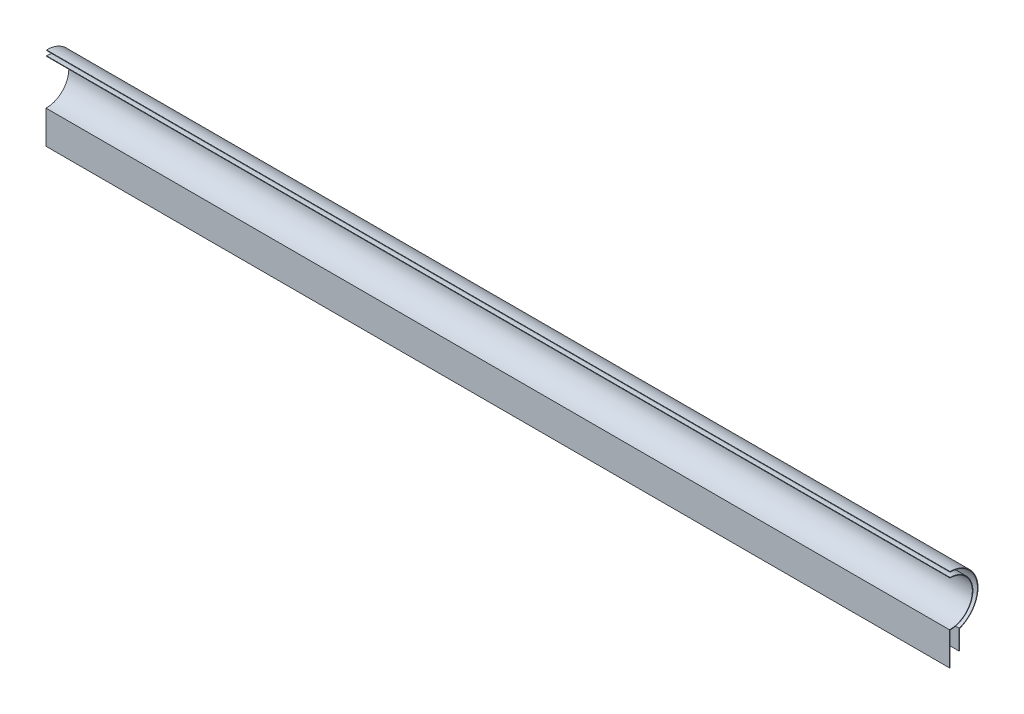
ISO-10303-21;
HEADER;
FILE_DESCRIPTION(('STEP AP214'),'2;1');
FILE_NAME('part.step','',(''),(''),'','','');
FILE_SCHEMA(('AUTOMOTIVE_DESIGN { 1 0 10303 214 1 1 1 1 }'));
ENDSEC;
DATA;
#1=APPLICATION_CONTEXT('core data for automotive mechanical design processes');
#2=APPLICATION_PROTOCOL_DEFINITION('international standard','automotive_design',2000,#1);
#3=PRODUCT_CONTEXT('',#1,'mechanical');
#4=PRODUCT('Part','Part','',(#3));
#5=PRODUCT_RELATED_PRODUCT_CATEGORY('part','',(#4));
#6=PRODUCT_DEFINITION_FORMATION('','',#4);
#7=PRODUCT_DEFINITION_CONTEXT('part definition',#1,'design');
#8=PRODUCT_DEFINITION('design','',#6,#7);
#9=PRODUCT_DEFINITION_SHAPE('','',#8);
#10=(LENGTH_UNIT() NAMED_UNIT(*) SI_UNIT(.MILLI.,.METRE.));
#11=(NAMED_UNIT(*) PLANE_ANGLE_UNIT() SI_UNIT($,.RADIAN.));
#12=(NAMED_UNIT(*) SI_UNIT($,.STERADIAN.) SOLID_ANGLE_UNIT());
#13=UNCERTAINTY_MEASURE_WITH_UNIT(LENGTH_MEASURE(1.E-05),#10,'distance_accuracy_value','');
#14=(GEOMETRIC_REPRESENTATION_CONTEXT(3) GLOBAL_UNCERTAINTY_ASSIGNED_CONTEXT((#13)) GLOBAL_UNIT_ASSIGNED_CONTEXT((#10,
#11,#12)) REPRESENTATION_CONTEXT('',''));
#15=CARTESIAN_POINT('',(0.,0.,0.));
#16=DIRECTION('',(0.,0.,1.));
#17=DIRECTION('',(1.,0.,0.));
#18=AXIS2_PLACEMENT_3D('',#15,#16,#17);
#19=CARTESIAN_POINT('',(-26.2029870226295,730.,-237.681641947689));
#20=DIRECTION('',(1.,0.,0.));
#21=DIRECTION('',(0.,0.,1.));
#22=AXIS2_PLACEMENT_3D('',#19,#20,#21);
#23=PLANE('',#22);
#24=DIRECTION('',(0.,0.,-1.));
#25=VECTOR('',#24,1.);
#26=CARTESIAN_POINT('',(-26.2029870226295,699.7,-237.681641947689));
#27=LINE('',#26,#25);
#28=CARTESIAN_POINT('',(-26.2029870226295,699.7,-237.381641947689));
#29=VERTEX_POINT('',#28);
#30=CARTESIAN_POINT('',(-26.2029870226295,699.7,-237.681641947689));
#31=VERTEX_POINT('',#30);
#32=EDGE_CURVE('E120',#29,#31,#27,.T.);
#33=ORIENTED_EDGE('',*,*,#32,.T.);
#34=DIRECTION('',(0.,-1.,0.));
#35=VECTOR('',#34,1.);
#36=CARTESIAN_POINT('',(-26.2029870226295,705.,-237.681641947689));
#37=LINE('',#36,#35);
#38=CARTESIAN_POINT('',(-26.2029870226295,717.5,-237.681641947689));
#39=VERTEX_POINT('',#38);
#40=EDGE_CURVE('E112',#39,#31,#37,.T.);
#41=ORIENTED_EDGE('',*,*,#40,.F.);
#42=CARTESIAN_POINT('',(-26.2029870226295,730.,-237.681641947689));
#43=DIRECTION('',(1.,0.,0.));
#44=DIRECTION('',(0.,0.,1.));
#45=AXIS2_PLACEMENT_3D('',#42,#43,#44);
#46=CIRCLE('',#45,12.5);
#47=CARTESIAN_POINT('',(-26.2029870226295,742.5,-237.681641947689));
#48=VERTEX_POINT('',#47);
#49=EDGE_CURVE('E135',#39,#48,#46,.T.);
#50=ORIENTED_EDGE('',*,*,#49,.T.);
#51=DIRECTION('',(0.,1.,0.));
#52=VECTOR('',#51,1.);
#53=CARTESIAN_POINT('',(-26.2029870226295,746.71253636167,-237.681641947689));
#54=LINE('',#53,#52);
#55=CARTESIAN_POINT('',(-26.2029870226295,742.2,-237.681641947689));
#56=VERTEX_POINT('',#55);
#57=EDGE_CURVE('E142',#56,#48,#54,.T.);
#58=ORIENTED_EDGE('',*,*,#57,.F.);
#59=CARTESIAN_POINT('',(-26.2029870226295,730.,-237.681641947689));
#60=DIRECTION('',(-1.,0.,0.));
#61=DIRECTION('',(0.,0.,1.));
#62=AXIS2_PLACEMENT_3D('',#59,#60,#61);
#63=CIRCLE('',#62,12.2);
#64=CARTESIAN_POINT('',(-26.2029870226295,717.80368908235,-237.381641947689));
#65=VERTEX_POINT('',#64);
#66=EDGE_CURVE('E143',#65,#56,#63,.F.);
#67=ORIENTED_EDGE('',*,*,#66,.F.);
#68=DIRECTION('',(0.,1.,0.));
#69=VECTOR('',#68,1.);
#70=CARTESIAN_POINT('',(-26.2029870226295,730.,-237.381641947689));
#71=LINE('',#70,#69);
#72=EDGE_CURVE('E141',#29,#65,#71,.T.);
#73=ORIENTED_EDGE('',*,*,#72,.F.);
#74=EDGE_LOOP('',(#33,#41,#50,#58,#67,#73));
#75=FACE_BOUND('',#74,.T.);
#76=ADVANCED_FACE('F47',(#75),#23,.T.);
#77=CARTESIAN_POINT('',(-521.202987022629,705.,-237.681641947689));
#78=DIRECTION('',(1.,0.,0.));
#79=DIRECTION('',(0.,0.,1.));
#80=AXIS2_PLACEMENT_3D('',#77,#78,#79);
#81=PLANE('',#80);
#82=DIRECTION('',(0.,-1.,0.));
#83=VECTOR('',#82,1.);
#84=CARTESIAN_POINT('',(-521.202987022629,717.5,-237.381641947689));
#85=LINE('',#84,#83);
#86=CARTESIAN_POINT('',(-521.202987022629,717.80368908235,-237.381641947689));
#87=VERTEX_POINT('',#86);
#88=CARTESIAN_POINT('',(-521.202987022629,699.7,-237.381641947689));
#89=VERTEX_POINT('',#88);
#90=EDGE_CURVE('E126',#87,#89,#85,.T.);
#91=ORIENTED_EDGE('',*,*,#90,.F.);
#92=CARTESIAN_POINT('',(-521.202987022629,730.,-237.681641947689));
#93=DIRECTION('',(-1.,0.,0.));
#94=DIRECTION('',(0.,0.,1.));
#95=AXIS2_PLACEMENT_3D('',#92,#93,#94);
#96=CIRCLE('',#95,12.2);
#97=CARTESIAN_POINT('',(-521.202987022629,742.2,-237.681641947689));
#98=VERTEX_POINT('',#97);
#99=EDGE_CURVE('E125',#87,#98,#96,.F.);
#100=ORIENTED_EDGE('',*,*,#99,.T.);
#101=DIRECTION('',(0.,1.,0.));
#102=VECTOR('',#101,1.);
#103=CARTESIAN_POINT('',(-521.202987022629,746.71253636167,-237.681641947689));
#104=LINE('',#103,#102);
#105=CARTESIAN_POINT('',(-521.202987022629,742.5,-237.681641947689));
#106=VERTEX_POINT('',#105);
#107=EDGE_CURVE('E139',#98,#106,#104,.T.);
#108=ORIENTED_EDGE('',*,*,#107,.T.);
#109=CARTESIAN_POINT('',(-521.202987022629,730.,-237.681641947689));
#110=DIRECTION('',(-1.,0.,0.));
#111=DIRECTION('',(0.,0.,1.));
#112=AXIS2_PLACEMENT_3D('',#109,#110,#111);
#113=CIRCLE('',#112,12.5);
#114=CARTESIAN_POINT('',(-521.202987022629,717.5,-237.681641947689));
#115=VERTEX_POINT('',#114);
#116=EDGE_CURVE('E124',#115,#106,#113,.F.);
#117=ORIENTED_EDGE('',*,*,#116,.F.);
#118=DIRECTION('',(0.,-1.,0.));
#119=VECTOR('',#118,1.);
#120=CARTESIAN_POINT('',(-521.202987022629,705.,-237.681641947689));
#121=LINE('',#120,#119);
#122=CARTESIAN_POINT('',(-521.202987022629,699.7,-237.681641947689));
#123=VERTEX_POINT('',#122);
#124=EDGE_CURVE('E109',#115,#123,#121,.T.);
#125=ORIENTED_EDGE('',*,*,#124,.T.);
#126=DIRECTION('',(0.,0.,-1.));
#127=VECTOR('',#126,1.);
#128=CARTESIAN_POINT('',(-521.202987022629,699.7,-237.681641947689));
#129=LINE('',#128,#127);
#130=EDGE_CURVE('E114',#89,#123,#129,.T.);
#131=ORIENTED_EDGE('',*,*,#130,.F.);
#132=EDGE_LOOP('',(#91,#100,#108,#117,#125,#131));
#133=FACE_BOUND('',#132,.T.);
#134=ADVANCED_FACE('F122',(#133),#81,.F.);
#135=CARTESIAN_POINT('',(-568.637151925155,717.5,-237.681641947689));
#136=DIRECTION('',(0.,0.,1.));
#137=DIRECTION('',(-1.,0.,0.));
#138=AXIS2_PLACEMENT_3D('',#135,#136,#137);
#139=PLANE('',#138);
#140=ORIENTED_EDGE('',*,*,#124,.F.);
#141=DIRECTION('',(1.,0.,0.));
#142=VECTOR('',#141,1.);
#143=CARTESIAN_POINT('',(-568.637151925155,717.5,-237.681641947689));
#144=LINE('',#143,#142);
#145=EDGE_CURVE('E87',#115,#39,#144,.T.);
#146=ORIENTED_EDGE('',*,*,#145,.T.);
#147=ORIENTED_EDGE('',*,*,#40,.T.);
#148=DIRECTION('',(1.,0.,0.));
#149=VECTOR('',#148,1.);
#150=CARTESIAN_POINT('',(-521.202987022629,699.7,-237.681641947689));
#151=LINE('',#150,#149);
#152=EDGE_CURVE('E106',#123,#31,#151,.T.);
#153=ORIENTED_EDGE('',*,*,#152,.F.);
#154=EDGE_LOOP('',(#140,#146,#147,#153));
#155=FACE_BOUND('',#154,.T.);
#156=ADVANCED_FACE('F107',(#155),#139,.F.);
#157=CARTESIAN_POINT('',(-568.637151925155,730.,-237.681641947689));
#158=DIRECTION('',(1.,0.,0.));
#159=DIRECTION('',(0.,0.,1.));
#160=AXIS2_PLACEMENT_3D('',#157,#158,#159);
#161=CYLINDRICAL_SURFACE('',#160,12.2);
#162=DIRECTION('',(1.,0.,0.));
#163=VECTOR('',#162,1.);
#164=CARTESIAN_POINT('',(-568.637151925155,742.2,-237.681641947689));
#165=LINE('',#164,#163);
#166=EDGE_CURVE('E69',#56,#98,#165,.F.);
#167=ORIENTED_EDGE('',*,*,#166,.T.);
#168=ORIENTED_EDGE('',*,*,#99,.F.);
#169=DIRECTION('',(1.,0.,0.));
#170=VECTOR('',#169,1.);
#171=CARTESIAN_POINT('',(-521.202987022629,717.80368908235,-237.381641947689));
#172=LINE('',#171,#170);
#173=EDGE_CURVE('E129',#87,#65,#172,.T.);
#174=ORIENTED_EDGE('',*,*,#173,.T.);
#175=ORIENTED_EDGE('',*,*,#66,.T.);
#176=EDGE_LOOP('',(#167,#168,#174,#175));
#177=FACE_BOUND('',#176,.T.);
#178=ADVANCED_FACE('F147',(#177),#161,.F.);
#179=CARTESIAN_POINT('',(-568.637151925155,717.5,-237.381641947689));
#180=DIRECTION('',(0.,0.,1.));
#181=DIRECTION('',(-1.,0.,0.));
#182=AXIS2_PLACEMENT_3D('',#179,#180,#181);
#183=PLANE('',#182);
#184=DIRECTION('',(1.,0.,0.));
#185=VECTOR('',#184,1.);
#186=CARTESIAN_POINT('',(-568.637151925155,699.7,-237.381641947689));
#187=LINE('',#186,#185);
#188=EDGE_CURVE('E12',#89,#29,#187,.T.);
#189=ORIENTED_EDGE('',*,*,#188,.T.);
#190=ORIENTED_EDGE('',*,*,#72,.T.);
#191=ORIENTED_EDGE('',*,*,#173,.F.);
#192=ORIENTED_EDGE('',*,*,#90,.T.);
#193=EDGE_LOOP('',(#189,#190,#191,#192));
#194=FACE_BOUND('',#193,.T.);
#195=ADVANCED_FACE('F152',(#194),#183,.T.);
#196=CARTESIAN_POINT('',(-568.637151925155,730.,-237.681641947689));
#197=DIRECTION('',(1.,0.,0.));
#198=DIRECTION('',(0.,0.,1.));
#199=AXIS2_PLACEMENT_3D('',#196,#197,#198);
#200=CYLINDRICAL_SURFACE('',#199,12.5);
#201=ORIENTED_EDGE('',*,*,#116,.T.);
#202=DIRECTION('',(1.,0.,0.));
#203=VECTOR('',#202,1.);
#204=CARTESIAN_POINT('',(-568.637151925155,742.5,-237.681641947689));
#205=LINE('',#204,#203);
#206=EDGE_CURVE('E55',#106,#48,#205,.T.);
#207=ORIENTED_EDGE('',*,*,#206,.T.);
#208=ORIENTED_EDGE('',*,*,#49,.F.);
#209=ORIENTED_EDGE('',*,*,#145,.F.);
#210=EDGE_LOOP('',(#201,#207,#208,#209));
#211=FACE_BOUND('',#210,.T.);
#212=ADVANCED_FACE('F157',(#211),#200,.T.);
#213=CARTESIAN_POINT('',(-26.2029870226295,746.71253636167,-237.681641947689));
#214=DIRECTION('',(0.,0.,-1.));
#215=DIRECTION('',(1.,0.,0.));
#216=AXIS2_PLACEMENT_3D('',#213,#214,#215);
#217=PLANE('',#216);
#218=ORIENTED_EDGE('',*,*,#166,.F.);
#219=ORIENTED_EDGE('',*,*,#57,.T.);
#220=ORIENTED_EDGE('',*,*,#206,.F.);
#221=ORIENTED_EDGE('',*,*,#107,.F.);
#222=EDGE_LOOP('',(#218,#219,#220,#221));
#223=FACE_BOUND('',#222,.T.);
#224=ADVANCED_FACE('F49',(#223),#217,.F.);
#225=CARTESIAN_POINT('',(-521.202987022629,699.7,-237.681641947689));
#226=DIRECTION('',(0.,1.,0.));
#227=DIRECTION('',(0.,0.,-1.));
#228=AXIS2_PLACEMENT_3D('',#225,#226,#227);
#229=PLANE('',#228);
#230=ORIENTED_EDGE('',*,*,#188,.F.);
#231=ORIENTED_EDGE('',*,*,#130,.T.);
#232=ORIENTED_EDGE('',*,*,#152,.T.);
#233=ORIENTED_EDGE('',*,*,#32,.F.);
#234=EDGE_LOOP('',(#230,#231,#232,#233));
#235=FACE_BOUND('',#234,.T.);
#236=ADVANCED_FACE('F116',(#235),#229,.F.);
#237=CLOSED_SHELL('',(#76,#134,#156,#178,#195,#212,#224,#236));
#238=MANIFOLD_SOLID_BREP('B2',#237);
#239=CARTESIAN_POINT('',(-568.637151925155,730.,-237.681641947689));
#240=DIRECTION('',(1.,0.,0.));
#241=DIRECTION('',(0.,0.,1.));
#242=AXIS2_PLACEMENT_3D('',#239,#240,#241);
#243=CYLINDRICAL_SURFACE('',#242,15.);
#244=CARTESIAN_POINT('',(-521.202987022629,730.,-237.681641947689));
#245=DIRECTION('',(-1.,0.,0.));
#246=DIRECTION('',(0.,0.,1.));
#247=AXIS2_PLACEMENT_3D('',#244,#245,#246);
#248=CIRCLE('',#247,15.);
#249=CARTESIAN_POINT('',(-521.202987022629,715.857864376269,-242.681641947689));
#250=VERTEX_POINT('',#249);
#251=CARTESIAN_POINT('',(-521.202987022629,745.,-237.681641947689));
#252=VERTEX_POINT('',#251);
#253=EDGE_CURVE('E294',#250,#252,#248,.F.);
#254=ORIENTED_EDGE('',*,*,#253,.F.);
#255=DIRECTION('',(1.,0.,0.));
#256=VECTOR('',#255,1.);
#257=CARTESIAN_POINT('',(-568.637151925155,715.857864376269,-242.681641947689));
#258=LINE('',#257,#256);
#259=CARTESIAN_POINT('',(-26.2029870226295,715.857864376269,-242.681641947689));
#260=VERTEX_POINT('',#259);
#261=EDGE_CURVE('E297',#250,#260,#258,.T.);
#262=ORIENTED_EDGE('',*,*,#261,.T.);
#263=CARTESIAN_POINT('',(-26.2029870226295,730.,-237.681641947689));
#264=DIRECTION('',(-1.,0.,0.));
#265=DIRECTION('',(0.,0.,1.));
#266=AXIS2_PLACEMENT_3D('',#263,#264,#265);
#267=CIRCLE('',#266,15.);
#268=CARTESIAN_POINT('',(-26.2029870226295,745.,-237.681641947689));
#269=VERTEX_POINT('',#268);
#270=EDGE_CURVE('E296',#269,#260,#267,.T.);
#271=ORIENTED_EDGE('',*,*,#270,.F.);
#272=DIRECTION('',(1.,0.,0.));
#273=VECTOR('',#272,1.);
#274=CARTESIAN_POINT('',(-568.637151925155,745.,-237.681641947689));
#275=LINE('',#274,#273);
#276=EDGE_CURVE('E283',#252,#269,#275,.T.);
#277=ORIENTED_EDGE('',*,*,#276,.F.);
#278=EDGE_LOOP('',(#254,#262,#271,#277));
#279=FACE_BOUND('',#278,.T.);
#280=ADVANCED_FACE('F226',(#279),#243,.F.);
#281=CARTESIAN_POINT('',(-568.637151925155,705.,-242.681641947689));
#282=DIRECTION('',(0.,0.,-1.));
#283=DIRECTION('',(1.,0.,0.));
#284=AXIS2_PLACEMENT_3D('',#281,#282,#283);
#285=PLANE('',#284);
#286=DIRECTION('',(0.,1.,0.));
#287=VECTOR('',#286,1.);
#288=CARTESIAN_POINT('',(-521.202987022629,705.,-242.681641947689));
#289=LINE('',#288,#287);
#290=CARTESIAN_POINT('',(-521.202987022629,705.,-242.681641947689));
#291=VERTEX_POINT('',#290);
#292=EDGE_CURVE('E301',#291,#250,#289,.T.);
#293=ORIENTED_EDGE('',*,*,#292,.F.);
#294=DIRECTION('',(1.,0.,0.));
#295=VECTOR('',#294,1.);
#296=CARTESIAN_POINT('',(-568.637151925155,705.,-242.681641947689));
#297=LINE('',#296,#295);
#298=CARTESIAN_POINT('',(-26.2029870226295,705.,-242.681641947689));
#299=VERTEX_POINT('',#298);
#300=EDGE_CURVE('E311',#291,#299,#297,.T.);
#301=ORIENTED_EDGE('',*,*,#300,.T.);
#302=DIRECTION('',(0.,-1.,0.));
#303=VECTOR('',#302,1.);
#304=CARTESIAN_POINT('',(-26.2029870226295,705.,-242.681641947689));
#305=LINE('',#304,#303);
#306=EDGE_CURVE('E306',#260,#299,#305,.T.);
#307=ORIENTED_EDGE('',*,*,#306,.F.);
#308=ORIENTED_EDGE('',*,*,#261,.F.);
#309=EDGE_LOOP('',(#293,#301,#307,#308));
#310=FACE_BOUND('',#309,.T.);
#311=ADVANCED_FACE('F334',(#310),#285,.F.);
#312=CARTESIAN_POINT('',(-521.202987022629,705.,-237.681641947689));
#313=DIRECTION('',(1.,0.,0.));
#314=DIRECTION('',(0.,0.,1.));
#315=AXIS2_PLACEMENT_3D('',#312,#313,#314);
#316=PLANE('',#315);
#317=ORIENTED_EDGE('',*,*,#292,.T.);
#318=ORIENTED_EDGE('',*,*,#253,.T.);
#319=DIRECTION('',(0.,1.,0.));
#320=VECTOR('',#319,1.);
#321=CARTESIAN_POINT('',(-521.202987022629,746.71253636167,-237.681641947689));
#322=LINE('',#321,#320);
#323=CARTESIAN_POINT('',(-521.202987022629,745.3,-237.681641947689));
#324=VERTEX_POINT('',#323);
#325=EDGE_CURVE('E279',#252,#324,#322,.T.);
#326=ORIENTED_EDGE('',*,*,#325,.T.);
#327=CARTESIAN_POINT('',(-521.202987022629,730.,-237.681641947689));
#328=DIRECTION('',(-1.,0.,0.));
#329=DIRECTION('',(0.,0.,1.));
#330=AXIS2_PLACEMENT_3D('',#327,#328,#329);
#331=CIRCLE('',#330,15.3);
#332=CARTESIAN_POINT('',(-521.202987022629,715.647299905593,-242.981641947689));
#333=VERTEX_POINT('',#332);
#334=EDGE_CURVE('E45',#333,#324,#331,.F.);
#335=ORIENTED_EDGE('',*,*,#334,.F.);
#336=DIRECTION('',(0.,1.,0.));
#337=VECTOR('',#336,1.);
#338=CARTESIAN_POINT('',(-521.202987022629,705.,-242.981641947689));
#339=LINE('',#338,#337);
#340=CARTESIAN_POINT('',(-521.202987022629,705.,-242.981641947689));
#341=VERTEX_POINT('',#340);
#342=EDGE_CURVE('E235',#341,#333,#339,.T.);
#343=ORIENTED_EDGE('',*,*,#342,.F.);
#344=DIRECTION('',(0.,0.,1.));
#345=VECTOR('',#344,1.);
#346=CARTESIAN_POINT('',(-521.202987022629,705.,-242.681641947689));
#347=LINE('',#346,#345);
#348=EDGE_CURVE('E327',#341,#291,#347,.T.);
#349=ORIENTED_EDGE('',*,*,#348,.T.);
#350=EDGE_LOOP('',(#317,#318,#326,#335,#343,#349));
#351=FACE_BOUND('',#350,.T.);
#352=ADVANCED_FACE('F299',(#351),#316,.F.);
#353=CARTESIAN_POINT('',(-26.2029870226295,730.,-237.681641947689));
#354=DIRECTION('',(1.,0.,0.));
#355=DIRECTION('',(0.,0.,1.));
#356=AXIS2_PLACEMENT_3D('',#353,#354,#355);
#357=PLANE('',#356);
#358=DIRECTION('',(0.,0.,1.));
#359=VECTOR('',#358,1.);
#360=CARTESIAN_POINT('',(-26.2029870226295,705.,-244.897619127658));
#361=LINE('',#360,#359);
#362=CARTESIAN_POINT('',(-26.2029870226295,705.,-242.981641947689));
#363=VERTEX_POINT('',#362);
#364=EDGE_CURVE('E323',#363,#299,#361,.T.);
#365=ORIENTED_EDGE('',*,*,#364,.F.);
#366=DIRECTION('',(0.,-1.,0.));
#367=VECTOR('',#366,1.);
#368=CARTESIAN_POINT('',(-26.2029870226295,730.,-242.981641947689));
#369=LINE('',#368,#367);
#370=CARTESIAN_POINT('',(-26.2029870226295,715.647299905593,-242.981641947689));
#371=VERTEX_POINT('',#370);
#372=EDGE_CURVE('E230',#371,#363,#369,.T.);
#373=ORIENTED_EDGE('',*,*,#372,.F.);
#374=CARTESIAN_POINT('',(-26.2029870226295,730.,-237.681641947689));
#375=DIRECTION('',(-1.,0.,0.));
#376=DIRECTION('',(0.,0.,1.));
#377=AXIS2_PLACEMENT_3D('',#374,#375,#376);
#378=CIRCLE('',#377,15.3);
#379=CARTESIAN_POINT('',(-26.2029870226295,745.3,-237.681641947689));
#380=VERTEX_POINT('',#379);
#381=EDGE_CURVE('E304',#380,#371,#378,.T.);
#382=ORIENTED_EDGE('',*,*,#381,.F.);
#383=DIRECTION('',(0.,1.,0.));
#384=VECTOR('',#383,1.);
#385=CARTESIAN_POINT('',(-26.2029870226295,746.71253636167,-237.681641947689));
#386=LINE('',#385,#384);
#387=EDGE_CURVE('E289',#269,#380,#386,.T.);
#388=ORIENTED_EDGE('',*,*,#387,.F.);
#389=ORIENTED_EDGE('',*,*,#270,.T.);
#390=ORIENTED_EDGE('',*,*,#306,.T.);
#391=EDGE_LOOP('',(#365,#373,#382,#388,#389,#390));
#392=FACE_BOUND('',#391,.T.);
#393=ADVANCED_FACE('F324',(#392),#357,.T.);
#394=CARTESIAN_POINT('',(-568.637151925155,730.,-237.681641947689));
#395=DIRECTION('',(1.,0.,0.));
#396=DIRECTION('',(0.,0.,1.));
#397=AXIS2_PLACEMENT_3D('',#394,#395,#396);
#398=CYLINDRICAL_SURFACE('',#397,15.3);
#399=DIRECTION('',(1.,0.,0.));
#400=VECTOR('',#399,1.);
#401=CARTESIAN_POINT('',(-568.637151925155,745.3,-237.681641947689));
#402=LINE('',#401,#400);
#403=EDGE_CURVE('E285',#324,#380,#402,.T.);
#404=ORIENTED_EDGE('',*,*,#403,.T.);
#405=ORIENTED_EDGE('',*,*,#381,.T.);
#406=DIRECTION('',(1.,0.,0.));
#407=VECTOR('',#406,1.);
#408=CARTESIAN_POINT('',(-521.202987022629,715.647299905593,-242.981641947689));
#409=LINE('',#408,#407);
#410=EDGE_CURVE('E243',#333,#371,#409,.T.);
#411=ORIENTED_EDGE('',*,*,#410,.F.);
#412=ORIENTED_EDGE('',*,*,#334,.T.);
#413=EDGE_LOOP('',(#404,#405,#411,#412));
#414=FACE_BOUND('',#413,.T.);
#415=ADVANCED_FACE('F228',(#414),#398,.T.);
#416=CARTESIAN_POINT('',(-568.637151925155,705.,-242.981641947689));
#417=DIRECTION('',(0.,0.,-1.));
#418=DIRECTION('',(1.,0.,0.));
#419=AXIS2_PLACEMENT_3D('',#416,#417,#418);
#420=PLANE('',#419);
#421=DIRECTION('',(-1.,0.,0.));
#422=VECTOR('',#421,1.);
#423=CARTESIAN_POINT('',(-568.637151925155,705.,-242.981641947689));
#424=LINE('',#423,#422);
#425=EDGE_CURVE('E314',#363,#341,#424,.T.);
#426=ORIENTED_EDGE('',*,*,#425,.T.);
#427=ORIENTED_EDGE('',*,*,#342,.T.);
#428=ORIENTED_EDGE('',*,*,#410,.T.);
#429=ORIENTED_EDGE('',*,*,#372,.T.);
#430=EDGE_LOOP('',(#426,#427,#428,#429));
#431=FACE_BOUND('',#430,.T.);
#432=ADVANCED_FACE('F319',(#431),#420,.T.);
#433=CARTESIAN_POINT('',(-26.2029870226295,746.71253636167,-237.681641947689));
#434=DIRECTION('',(0.,0.,-1.));
#435=DIRECTION('',(1.,0.,0.));
#436=AXIS2_PLACEMENT_3D('',#433,#434,#435);
#437=PLANE('',#436);
#438=ORIENTED_EDGE('',*,*,#403,.F.);
#439=ORIENTED_EDGE('',*,*,#325,.F.);
#440=ORIENTED_EDGE('',*,*,#276,.T.);
#441=ORIENTED_EDGE('',*,*,#387,.T.);
#442=EDGE_LOOP('',(#438,#439,#440,#441));
#443=FACE_BOUND('',#442,.T.);
#444=ADVANCED_FACE('F281',(#443),#437,.F.);
#445=CARTESIAN_POINT('',(-26.2029870226295,705.,-242.681641947689));
#446=DIRECTION('',(0.,1.,0.));
#447=DIRECTION('',(0.,0.,-1.));
#448=AXIS2_PLACEMENT_3D('',#445,#446,#447);
#449=PLANE('',#448);
#450=ORIENTED_EDGE('',*,*,#425,.F.);
#451=ORIENTED_EDGE('',*,*,#364,.T.);
#452=ORIENTED_EDGE('',*,*,#300,.F.);
#453=ORIENTED_EDGE('',*,*,#348,.F.);
#454=EDGE_LOOP('',(#450,#451,#452,#453));
#455=FACE_BOUND('',#454,.T.);
#456=ADVANCED_FACE('F335',(#455),#449,.F.);
#457=CLOSED_SHELL('',(#280,#311,#352,#393,#415,#432,#444,#456));
#458=MANIFOLD_SOLID_BREP('B6',#457);
#459=ADVANCED_BREP_SHAPE_REPRESENTATION('',(#18,#238,#458),#14);
#460=SHAPE_DEFINITION_REPRESENTATION(#9,#459);
ENDSEC;
END-ISO-10303-21;
